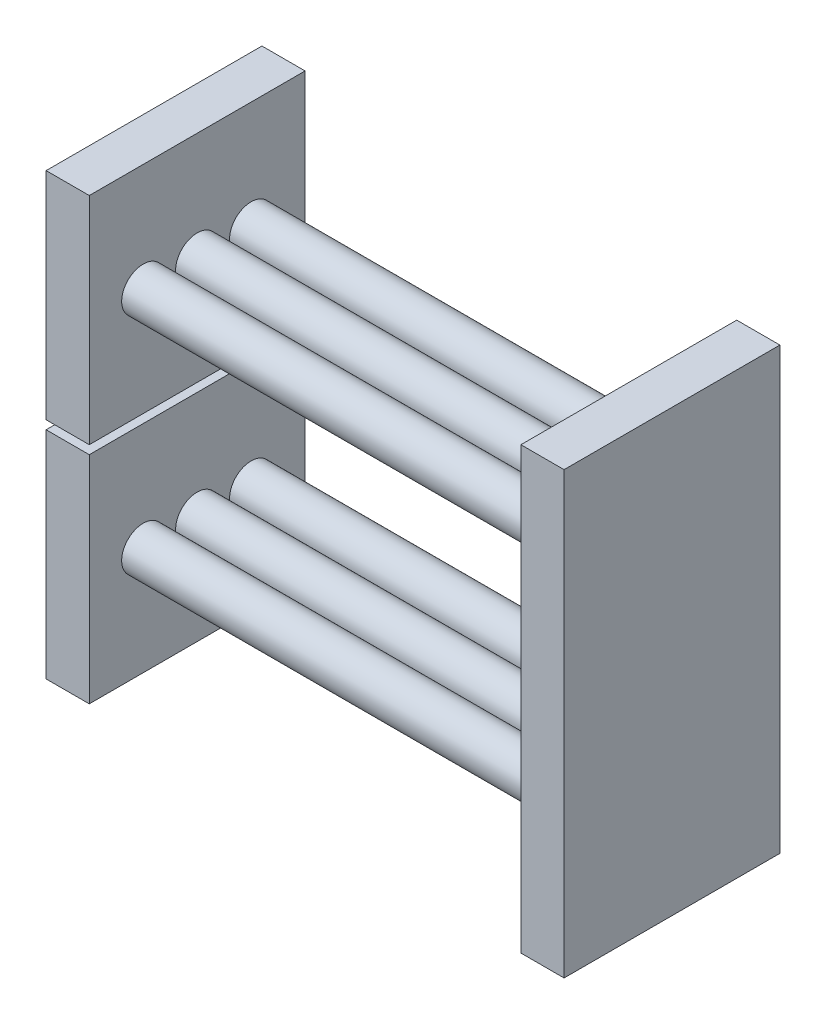
ISO-10303-21;
HEADER;
FILE_DESCRIPTION(('STEP AP214'),'2;1');
FILE_NAME('part.step','',(''),(''),'','','');
FILE_SCHEMA(('AUTOMOTIVE_DESIGN { 1 0 10303 214 1 1 1 1 }'));
ENDSEC;
DATA;
#1=APPLICATION_CONTEXT('core data for automotive mechanical design processes');
#2=APPLICATION_PROTOCOL_DEFINITION('international standard','automotive_design',2000,#1);
#3=PRODUCT_CONTEXT('',#1,'mechanical');
#4=PRODUCT('Part','Part','',(#3));
#5=PRODUCT_RELATED_PRODUCT_CATEGORY('part','',(#4));
#6=PRODUCT_DEFINITION_FORMATION('','',#4);
#7=PRODUCT_DEFINITION_CONTEXT('part definition',#1,'design');
#8=PRODUCT_DEFINITION('design','',#6,#7);
#9=PRODUCT_DEFINITION_SHAPE('','',#8);
#10=(LENGTH_UNIT() NAMED_UNIT(*) SI_UNIT(.MILLI.,.METRE.));
#11=(NAMED_UNIT(*) PLANE_ANGLE_UNIT() SI_UNIT($,.RADIAN.));
#12=(NAMED_UNIT(*) SI_UNIT($,.STERADIAN.) SOLID_ANGLE_UNIT());
#13=UNCERTAINTY_MEASURE_WITH_UNIT(LENGTH_MEASURE(1.E-05),#10,'distance_accuracy_value','');
#14=(GEOMETRIC_REPRESENTATION_CONTEXT(3) GLOBAL_UNCERTAINTY_ASSIGNED_CONTEXT((#13)) GLOBAL_UNIT_ASSIGNED_CONTEXT((#10,
#11,#12)) REPRESENTATION_CONTEXT('',''));
#15=CARTESIAN_POINT('',(0.,0.,0.));
#16=DIRECTION('',(0.,0.,1.));
#17=DIRECTION('',(1.,0.,0.));
#18=AXIS2_PLACEMENT_3D('',#15,#16,#17);
#19=CARTESIAN_POINT('',(0.,-52.,0.));
#20=DIRECTION('',(1.,0.,0.));
#21=DIRECTION('',(0.,0.,-1.));
#22=AXIS2_PLACEMENT_3D('',#19,#20,#21);
#23=PLANE('',#22);
#24=DIRECTION('',(0.,-1.,0.));
#25=VECTOR('',#24,1.);
#26=CARTESIAN_POINT('',(0.,-27.,-25.));
#27=LINE('',#26,#25);
#28=CARTESIAN_POINT('',(0.,-27.,-25.));
#29=VERTEX_POINT('',#28);
#30=CARTESIAN_POINT('',(0.,-77.,-25.));
#31=VERTEX_POINT('',#30);
#32=EDGE_CURVE('E181',#29,#31,#27,.T.);
#33=ORIENTED_EDGE('',*,*,#32,.T.);
#34=DIRECTION('',(0.,0.,1.));
#35=VECTOR('',#34,1.);
#36=CARTESIAN_POINT('',(0.,-77.,-25.));
#37=LINE('',#36,#35);
#38=CARTESIAN_POINT('',(0.,-77.,25.));
#39=VERTEX_POINT('',#38);
#40=EDGE_CURVE('E198',#31,#39,#37,.T.);
#41=ORIENTED_EDGE('',*,*,#40,.T.);
#42=DIRECTION('',(0.,-1.,0.));
#43=VECTOR('',#42,1.);
#44=CARTESIAN_POINT('',(0.,-27.,25.));
#45=LINE('',#44,#43);
#46=CARTESIAN_POINT('',(0.,-27.,25.));
#47=VERTEX_POINT('',#46);
#48=EDGE_CURVE('E201',#47,#39,#45,.T.);
#49=ORIENTED_EDGE('',*,*,#48,.F.);
#50=DIRECTION('',(0.,0.,1.));
#51=VECTOR('',#50,1.);
#52=CARTESIAN_POINT('',(0.,-27.,-25.));
#53=LINE('',#52,#51);
#54=EDGE_CURVE('E188',#29,#47,#53,.T.);
#55=ORIENTED_EDGE('',*,*,#54,.F.);
#56=EDGE_LOOP('',(#33,#41,#49,#55));
#57=FACE_BOUND('',#56,.T.);
#58=CARTESIAN_POINT('',(0.,-47.,4.99999999999999));
#59=DIRECTION('',(1.,0.,0.));
#60=DIRECTION('',(0.,0.,-1.));
#61=AXIS2_PLACEMENT_3D('',#58,#59,#60);
#62=CIRCLE('',#61,10.);
#63=CARTESIAN_POINT('',(0.,-47.,-5.00000000000001));
#64=VERTEX_POINT('',#63);
#65=EDGE_CURVE('E11',#64,#64,#62,.F.);
#66=ORIENTED_EDGE('',*,*,#65,.F.);
#67=EDGE_LOOP('',(#66));
#68=FACE_BOUND('',#67,.T.);
#69=ADVANCED_FACE('F39',(#57,#68),#23,.F.);
#70=CARTESIAN_POINT('',(0.,0.,0.));
#71=DIRECTION('',(1.,0.,0.));
#72=DIRECTION('',(0.,0.,-1.));
#73=AXIS2_PLACEMENT_3D('',#70,#71,#72);
#74=PLANE('',#73);
#75=DIRECTION('',(0.,1.,0.));
#76=VECTOR('',#75,1.);
#77=CARTESIAN_POINT('',(0.,-25.,-25.));
#78=LINE('',#77,#76);
#79=CARTESIAN_POINT('',(0.,-25.,-25.));
#80=VERTEX_POINT('',#79);
#81=CARTESIAN_POINT('',(0.,25.,-25.));
#82=VERTEX_POINT('',#81);
#83=EDGE_CURVE('E243',#80,#82,#78,.T.);
#84=ORIENTED_EDGE('',*,*,#83,.F.);
#85=DIRECTION('',(0.,0.,1.));
#86=VECTOR('',#85,1.);
#87=CARTESIAN_POINT('',(0.,-25.,-25.));
#88=LINE('',#87,#86);
#89=CARTESIAN_POINT('',(0.,-25.,25.));
#90=VERTEX_POINT('',#89);
#91=EDGE_CURVE('E248',#80,#90,#88,.T.);
#92=ORIENTED_EDGE('',*,*,#91,.T.);
#93=DIRECTION('',(0.,1.,0.));
#94=VECTOR('',#93,1.);
#95=CARTESIAN_POINT('',(0.,-25.,25.));
#96=LINE('',#95,#94);
#97=CARTESIAN_POINT('',(0.,25.,25.));
#98=VERTEX_POINT('',#97);
#99=EDGE_CURVE('E259',#90,#98,#96,.T.);
#100=ORIENTED_EDGE('',*,*,#99,.T.);
#101=DIRECTION('',(0.,0.,1.));
#102=VECTOR('',#101,1.);
#103=CARTESIAN_POINT('',(0.,25.,-25.));
#104=LINE('',#103,#102);
#105=EDGE_CURVE('E256',#82,#98,#104,.T.);
#106=ORIENTED_EDGE('',*,*,#105,.F.);
#107=EDGE_LOOP('',(#84,#92,#100,#106));
#108=FACE_BOUND('',#107,.T.);
#109=CARTESIAN_POINT('',(0.,0.,4.99999999999999));
#110=DIRECTION('',(1.,0.,0.));
#111=DIRECTION('',(0.,0.,-1.));
#112=AXIS2_PLACEMENT_3D('',#109,#110,#111);
#113=CIRCLE('',#112,10.);
#114=CARTESIAN_POINT('',(0.,0.,-5.00000000000001));
#115=VERTEX_POINT('',#114);
#116=EDGE_CURVE('E49',#115,#115,#113,.F.);
#117=ORIENTED_EDGE('',*,*,#116,.F.);
#118=EDGE_LOOP('',(#117));
#119=FACE_BOUND('',#118,.T.);
#120=ADVANCED_FACE('F277',(#108,#119),#74,.F.);
#121=CARTESIAN_POINT('',(10.,-25.,-25.));
#122=DIRECTION('',(0.,0.,1.));
#123=DIRECTION('',(1.,0.,0.));
#124=AXIS2_PLACEMENT_3D('',#121,#122,#123);
#125=PLANE('',#124);
#126=ORIENTED_EDGE('',*,*,#83,.T.);
#127=DIRECTION('',(-1.,0.,0.));
#128=VECTOR('',#127,1.);
#129=CARTESIAN_POINT('',(10.,25.,-25.));
#130=LINE('',#129,#128);
#131=CARTESIAN_POINT('',(10.,25.,-25.));
#132=VERTEX_POINT('',#131);
#133=EDGE_CURVE('E268',#132,#82,#130,.T.);
#134=ORIENTED_EDGE('',*,*,#133,.F.);
#135=DIRECTION('',(0.,1.,0.));
#136=VECTOR('',#135,1.);
#137=CARTESIAN_POINT('',(10.,-25.,-25.));
#138=LINE('',#137,#136);
#139=CARTESIAN_POINT('',(10.,-25.,-25.));
#140=VERTEX_POINT('',#139);
#141=EDGE_CURVE('E246',#140,#132,#138,.T.);
#142=ORIENTED_EDGE('',*,*,#141,.F.);
#143=DIRECTION('',(-1.,0.,0.));
#144=VECTOR('',#143,1.);
#145=CARTESIAN_POINT('',(10.,-25.,-25.));
#146=LINE('',#145,#144);
#147=EDGE_CURVE('E57',#140,#80,#146,.T.);
#148=ORIENTED_EDGE('',*,*,#147,.T.);
#149=EDGE_LOOP('',(#126,#134,#142,#148));
#150=FACE_BOUND('',#149,.T.);
#151=ADVANCED_FACE('F41',(#150),#125,.F.);
#152=CARTESIAN_POINT('',(10.,25.,-25.));
#153=DIRECTION('',(0.,-1.,0.));
#154=DIRECTION('',(0.,0.,-1.));
#155=AXIS2_PLACEMENT_3D('',#152,#153,#154);
#156=PLANE('',#155);
#157=ORIENTED_EDGE('',*,*,#105,.T.);
#158=DIRECTION('',(-1.,0.,0.));
#159=VECTOR('',#158,1.);
#160=CARTESIAN_POINT('',(10.,25.,25.));
#161=LINE('',#160,#159);
#162=CARTESIAN_POINT('',(10.,25.,25.));
#163=VERTEX_POINT('',#162);
#164=EDGE_CURVE('E266',#163,#98,#161,.T.);
#165=ORIENTED_EDGE('',*,*,#164,.F.);
#166=DIRECTION('',(0.,0.,1.));
#167=VECTOR('',#166,1.);
#168=CARTESIAN_POINT('',(10.,25.,-25.));
#169=LINE('',#168,#167);
#170=EDGE_CURVE('E84',#132,#163,#169,.T.);
#171=ORIENTED_EDGE('',*,*,#170,.F.);
#172=ORIENTED_EDGE('',*,*,#133,.T.);
#173=EDGE_LOOP('',(#157,#165,#171,#172));
#174=FACE_BOUND('',#173,.T.);
#175=ADVANCED_FACE('F285',(#174),#156,.F.);
#176=CARTESIAN_POINT('',(10.,-25.,25.));
#177=DIRECTION('',(0.,0.,1.));
#178=DIRECTION('',(1.,0.,0.));
#179=AXIS2_PLACEMENT_3D('',#176,#177,#178);
#180=PLANE('',#179);
#181=ORIENTED_EDGE('',*,*,#99,.F.);
#182=DIRECTION('',(-1.,0.,0.));
#183=VECTOR('',#182,1.);
#184=CARTESIAN_POINT('',(10.,-25.,25.));
#185=LINE('',#184,#183);
#186=CARTESIAN_POINT('',(10.,-25.,25.));
#187=VERTEX_POINT('',#186);
#188=EDGE_CURVE('E72',#187,#90,#185,.T.);
#189=ORIENTED_EDGE('',*,*,#188,.F.);
#190=DIRECTION('',(0.,1.,0.));
#191=VECTOR('',#190,1.);
#192=CARTESIAN_POINT('',(10.,-25.,25.));
#193=LINE('',#192,#191);
#194=EDGE_CURVE('E250',#187,#163,#193,.T.);
#195=ORIENTED_EDGE('',*,*,#194,.T.);
#196=ORIENTED_EDGE('',*,*,#164,.T.);
#197=EDGE_LOOP('',(#181,#189,#195,#196));
#198=FACE_BOUND('',#197,.T.);
#199=ADVANCED_FACE('F306',(#198),#180,.T.);
#200=CARTESIAN_POINT('',(10.,-25.,-25.));
#201=DIRECTION('',(0.,-1.,0.));
#202=DIRECTION('',(0.,0.,-1.));
#203=AXIS2_PLACEMENT_3D('',#200,#201,#202);
#204=PLANE('',#203);
#205=ORIENTED_EDGE('',*,*,#91,.F.);
#206=ORIENTED_EDGE('',*,*,#147,.F.);
#207=DIRECTION('',(0.,0.,1.));
#208=VECTOR('',#207,1.);
#209=CARTESIAN_POINT('',(10.,-25.,-25.));
#210=LINE('',#209,#208);
#211=EDGE_CURVE('E253',#140,#187,#210,.T.);
#212=ORIENTED_EDGE('',*,*,#211,.T.);
#213=ORIENTED_EDGE('',*,*,#188,.T.);
#214=EDGE_LOOP('',(#205,#206,#212,#213));
#215=FACE_BOUND('',#214,.T.);
#216=ADVANCED_FACE('F301',(#215),#204,.T.);
#217=CARTESIAN_POINT('',(10.,0.,0.));
#218=DIRECTION('',(1.,0.,0.));
#219=DIRECTION('',(0.,0.,-1.));
#220=AXIS2_PLACEMENT_3D('',#217,#218,#219);
#221=PLANE('',#220);
#222=CARTESIAN_POINT('',(10.,0.,12.5));
#223=DIRECTION('',(1.,0.,0.));
#224=DIRECTION('',(0.,0.,-1.));
#225=AXIS2_PLACEMENT_3D('',#222,#223,#224);
#226=CIRCLE('',#225,5.);
#227=CARTESIAN_POINT('',(10.,0.,7.5));
#228=VERTEX_POINT('',#227);
#229=EDGE_CURVE('E227',#228,#228,#226,.T.);
#230=ORIENTED_EDGE('',*,*,#229,.F.);
#231=EDGE_LOOP('',(#230));
#232=FACE_BOUND('',#231,.T.);
#233=CARTESIAN_POINT('',(10.,0.,-12.5));
#234=DIRECTION('',(1.,0.,0.));
#235=DIRECTION('',(0.,0.,-1.));
#236=AXIS2_PLACEMENT_3D('',#233,#234,#235);
#237=CIRCLE('',#236,5.);
#238=CARTESIAN_POINT('',(10.,0.,-17.5));
#239=VERTEX_POINT('',#238);
#240=EDGE_CURVE('E233',#239,#239,#237,.T.);
#241=ORIENTED_EDGE('',*,*,#240,.F.);
#242=EDGE_LOOP('',(#241));
#243=FACE_BOUND('',#242,.T.);
#244=CARTESIAN_POINT('',(10.,0.,0.));
#245=DIRECTION('',(1.,0.,0.));
#246=DIRECTION('',(0.,0.,-1.));
#247=AXIS2_PLACEMENT_3D('',#244,#245,#246);
#248=CIRCLE('',#247,5.);
#249=CARTESIAN_POINT('',(10.,0.,-5.));
#250=VERTEX_POINT('',#249);
#251=EDGE_CURVE('E239',#250,#250,#248,.T.);
#252=ORIENTED_EDGE('',*,*,#251,.F.);
#253=EDGE_LOOP('',(#252));
#254=FACE_BOUND('',#253,.T.);
#255=ORIENTED_EDGE('',*,*,#141,.T.);
#256=ORIENTED_EDGE('',*,*,#170,.T.);
#257=ORIENTED_EDGE('',*,*,#194,.F.);
#258=ORIENTED_EDGE('',*,*,#211,.F.);
#259=EDGE_LOOP('',(#255,#256,#257,#258));
#260=FACE_BOUND('',#259,.T.);
#261=ADVANCED_FACE('F293',(#232,#243,#254,#260),#221,.T.);
#262=ORIENTED_EDGE('',*,*,#116,.T.);
#263=EDGE_LOOP('',(#262));
#264=FACE_BOUND('',#263,.T.);
#265=ADVANCED_FACE('F275',(#264),#74,.F.);
#266=CARTESIAN_POINT('',(110.,0.,0.));
#267=DIRECTION('',(-1.,0.,0.));
#268=DIRECTION('',(0.,0.,1.));
#269=AXIS2_PLACEMENT_3D('',#266,#267,#268);
#270=CYLINDRICAL_SURFACE('',#269,5.);
#271=CARTESIAN_POINT('',(110.,0.,0.));
#272=DIRECTION('',(1.,0.,0.));
#273=DIRECTION('',(0.,0.,-1.));
#274=AXIS2_PLACEMENT_3D('',#271,#272,#273);
#275=CIRCLE('',#274,5.);
#276=CARTESIAN_POINT('',(110.,0.,-5.));
#277=VERTEX_POINT('',#276);
#278=EDGE_CURVE('E240',#277,#277,#275,.T.);
#279=ORIENTED_EDGE('',*,*,#278,.F.);
#280=EDGE_LOOP('',(#279));
#281=FACE_BOUND('',#280,.T.);
#282=ORIENTED_EDGE('',*,*,#251,.T.);
#283=EDGE_LOOP('',(#282));
#284=FACE_BOUND('',#283,.T.);
#285=ADVANCED_FACE('F292',(#281,#284),#270,.T.);
#286=CARTESIAN_POINT('',(110.,0.,-12.5));
#287=DIRECTION('',(-1.,0.,0.));
#288=DIRECTION('',(0.,0.,1.));
#289=AXIS2_PLACEMENT_3D('',#286,#287,#288);
#290=CYLINDRICAL_SURFACE('',#289,5.);
#291=CARTESIAN_POINT('',(110.,0.,-12.5));
#292=DIRECTION('',(1.,0.,0.));
#293=DIRECTION('',(0.,0.,-1.));
#294=AXIS2_PLACEMENT_3D('',#291,#292,#293);
#295=CIRCLE('',#294,5.);
#296=CARTESIAN_POINT('',(110.,0.,-17.5));
#297=VERTEX_POINT('',#296);
#298=EDGE_CURVE('E236',#297,#297,#295,.T.);
#299=ORIENTED_EDGE('',*,*,#298,.F.);
#300=EDGE_LOOP('',(#299));
#301=FACE_BOUND('',#300,.T.);
#302=ORIENTED_EDGE('',*,*,#240,.T.);
#303=EDGE_LOOP('',(#302));
#304=FACE_BOUND('',#303,.T.);
#305=ADVANCED_FACE('F298',(#301,#304),#290,.T.);
#306=CARTESIAN_POINT('',(110.,0.,12.5));
#307=DIRECTION('',(-1.,0.,0.));
#308=DIRECTION('',(0.,0.,1.));
#309=AXIS2_PLACEMENT_3D('',#306,#307,#308);
#310=CYLINDRICAL_SURFACE('',#309,5.);
#311=CARTESIAN_POINT('',(110.,0.,12.5));
#312=DIRECTION('',(1.,0.,0.));
#313=DIRECTION('',(0.,0.,-1.));
#314=AXIS2_PLACEMENT_3D('',#311,#312,#313);
#315=CIRCLE('',#314,5.);
#316=CARTESIAN_POINT('',(110.,0.,7.5));
#317=VERTEX_POINT('',#316);
#318=EDGE_CURVE('E230',#317,#317,#315,.T.);
#319=ORIENTED_EDGE('',*,*,#318,.F.);
#320=EDGE_LOOP('',(#319));
#321=FACE_BOUND('',#320,.T.);
#322=ORIENTED_EDGE('',*,*,#229,.T.);
#323=EDGE_LOOP('',(#322));
#324=FACE_BOUND('',#323,.T.);
#325=ADVANCED_FACE('F312',(#321,#324),#310,.T.);
#326=CARTESIAN_POINT('',(120.,25.,25.));
#327=DIRECTION('',(0.,0.,-1.));
#328=DIRECTION('',(0.,1.,0.));
#329=AXIS2_PLACEMENT_3D('',#326,#327,#328);
#330=PLANE('',#329);
#331=DIRECTION('',(0.,-1.,0.));
#332=VECTOR('',#331,1.);
#333=CARTESIAN_POINT('',(110.,25.,25.));
#334=LINE('',#333,#332);
#335=CARTESIAN_POINT('',(110.,25.,25.));
#336=VERTEX_POINT('',#335);
#337=CARTESIAN_POINT('',(110.,-77.,25.));
#338=VERTEX_POINT('',#337);
#339=EDGE_CURVE('E215',#336,#338,#334,.T.);
#340=ORIENTED_EDGE('',*,*,#339,.T.);
#341=DIRECTION('',(-1.,0.,0.));
#342=VECTOR('',#341,1.);
#343=CARTESIAN_POINT('',(120.,-77.,25.));
#344=LINE('',#343,#342);
#345=CARTESIAN_POINT('',(120.,-77.,25.));
#346=VERTEX_POINT('',#345);
#347=EDGE_CURVE('E155',#346,#338,#344,.T.);
#348=ORIENTED_EDGE('',*,*,#347,.F.);
#349=DIRECTION('',(0.,-1.,0.));
#350=VECTOR('',#349,1.);
#351=CARTESIAN_POINT('',(120.,25.,25.));
#352=LINE('',#351,#350);
#353=CARTESIAN_POINT('',(120.,25.,25.));
#354=VERTEX_POINT('',#353);
#355=EDGE_CURVE('E146',#354,#346,#352,.T.);
#356=ORIENTED_EDGE('',*,*,#355,.F.);
#357=DIRECTION('',(-1.,0.,0.));
#358=VECTOR('',#357,1.);
#359=CARTESIAN_POINT('',(120.,25.,25.));
#360=LINE('',#359,#358);
#361=EDGE_CURVE('E219',#354,#336,#360,.T.);
#362=ORIENTED_EDGE('',*,*,#361,.T.);
#363=EDGE_LOOP('',(#340,#348,#356,#362));
#364=FACE_BOUND('',#363,.T.);
#365=ADVANCED_FACE('F316',(#364),#330,.F.);
#366=CARTESIAN_POINT('',(120.,25.,-25.));
#367=DIRECTION('',(0.,0.,1.));
#368=DIRECTION('',(0.,-1.,0.));
#369=AXIS2_PLACEMENT_3D('',#366,#367,#368);
#370=PLANE('',#369);
#371=DIRECTION('',(0.,1.,0.));
#372=VECTOR('',#371,1.);
#373=CARTESIAN_POINT('',(110.,25.,-25.));
#374=LINE('',#373,#372);
#375=CARTESIAN_POINT('',(110.,-77.,-25.));
#376=VERTEX_POINT('',#375);
#377=CARTESIAN_POINT('',(110.,25.,-25.));
#378=VERTEX_POINT('',#377);
#379=EDGE_CURVE('E221',#376,#378,#374,.T.);
#380=ORIENTED_EDGE('',*,*,#379,.T.);
#381=DIRECTION('',(-1.,0.,0.));
#382=VECTOR('',#381,1.);
#383=CARTESIAN_POINT('',(120.,25.,-25.));
#384=LINE('',#383,#382);
#385=CARTESIAN_POINT('',(120.,25.,-25.));
#386=VERTEX_POINT('',#385);
#387=EDGE_CURVE('E142',#386,#378,#384,.T.);
#388=ORIENTED_EDGE('',*,*,#387,.F.);
#389=DIRECTION('',(0.,1.,0.));
#390=VECTOR('',#389,1.);
#391=CARTESIAN_POINT('',(120.,25.,-25.));
#392=LINE('',#391,#390);
#393=CARTESIAN_POINT('',(120.,-77.,-25.));
#394=VERTEX_POINT('',#393);
#395=EDGE_CURVE('E136',#394,#386,#392,.T.);
#396=ORIENTED_EDGE('',*,*,#395,.F.);
#397=DIRECTION('',(-1.,0.,0.));
#398=VECTOR('',#397,1.);
#399=CARTESIAN_POINT('',(120.,-77.,-25.));
#400=LINE('',#399,#398);
#401=EDGE_CURVE('E140',#394,#376,#400,.T.);
#402=ORIENTED_EDGE('',*,*,#401,.T.);
#403=EDGE_LOOP('',(#380,#388,#396,#402));
#404=FACE_BOUND('',#403,.T.);
#405=ADVANCED_FACE('F138',(#404),#370,.F.);
#406=CARTESIAN_POINT('',(120.,25.,25.));
#407=DIRECTION('',(0.,-1.,0.));
#408=DIRECTION('',(0.,0.,-1.));
#409=AXIS2_PLACEMENT_3D('',#406,#407,#408);
#410=PLANE('',#409);
#411=DIRECTION('',(0.,0.,1.));
#412=VECTOR('',#411,1.);
#413=CARTESIAN_POINT('',(110.,25.,25.));
#414=LINE('',#413,#412);
#415=EDGE_CURVE('E216',#378,#336,#414,.T.);
#416=ORIENTED_EDGE('',*,*,#415,.T.);
#417=ORIENTED_EDGE('',*,*,#361,.F.);
#418=DIRECTION('',(0.,0.,1.));
#419=VECTOR('',#418,1.);
#420=CARTESIAN_POINT('',(120.,25.,25.));
#421=LINE('',#420,#419);
#422=EDGE_CURVE('E145',#386,#354,#421,.T.);
#423=ORIENTED_EDGE('',*,*,#422,.F.);
#424=ORIENTED_EDGE('',*,*,#387,.T.);
#425=EDGE_LOOP('',(#416,#417,#423,#424));
#426=FACE_BOUND('',#425,.T.);
#427=ADVANCED_FACE('F323',(#426),#410,.F.);
#428=CARTESIAN_POINT('',(120.,0.,0.));
#429=DIRECTION('',(1.,0.,0.));
#430=DIRECTION('',(0.,0.,-1.));
#431=AXIS2_PLACEMENT_3D('',#428,#429,#430);
#432=PLANE('',#431);
#433=ORIENTED_EDGE('',*,*,#355,.T.);
#434=DIRECTION('',(0.,0.,1.));
#435=VECTOR('',#434,1.);
#436=CARTESIAN_POINT('',(120.,-77.,25.));
#437=LINE('',#436,#435);
#438=EDGE_CURVE('E149',#394,#346,#437,.T.);
#439=ORIENTED_EDGE('',*,*,#438,.F.);
#440=ORIENTED_EDGE('',*,*,#395,.T.);
#441=ORIENTED_EDGE('',*,*,#422,.T.);
#442=EDGE_LOOP('',(#433,#439,#440,#441));
#443=FACE_BOUND('',#442,.T.);
#444=ADVANCED_FACE('F150',(#443),#432,.T.);
#445=CARTESIAN_POINT('',(110.,0.,0.));
#446=DIRECTION('',(1.,0.,0.));
#447=DIRECTION('',(0.,0.,-1.));
#448=AXIS2_PLACEMENT_3D('',#445,#446,#447);
#449=PLANE('',#448);
#450=ORIENTED_EDGE('',*,*,#278,.T.);
#451=EDGE_LOOP('',(#450));
#452=FACE_BOUND('',#451,.T.);
#453=ORIENTED_EDGE('',*,*,#298,.T.);
#454=EDGE_LOOP('',(#453));
#455=FACE_BOUND('',#454,.T.);
#456=ORIENTED_EDGE('',*,*,#318,.T.);
#457=EDGE_LOOP('',(#456));
#458=FACE_BOUND('',#457,.T.);
#459=ORIENTED_EDGE('',*,*,#339,.F.);
#460=ORIENTED_EDGE('',*,*,#415,.F.);
#461=ORIENTED_EDGE('',*,*,#379,.F.);
#462=DIRECTION('',(0.,0.,1.));
#463=VECTOR('',#462,1.);
#464=CARTESIAN_POINT('',(110.,-77.,25.));
#465=LINE('',#464,#463);
#466=EDGE_CURVE('E156',#376,#338,#465,.T.);
#467=ORIENTED_EDGE('',*,*,#466,.T.);
#468=EDGE_LOOP('',(#459,#460,#461,#467));
#469=FACE_BOUND('',#468,.T.);
#470=CARTESIAN_POINT('',(110.,-52.,0.));
#471=DIRECTION('',(-1.,0.,0.));
#472=DIRECTION('',(0.,0.,-1.));
#473=AXIS2_PLACEMENT_3D('',#470,#471,#472);
#474=CIRCLE('',#473,5.);
#475=CARTESIAN_POINT('',(110.,-52.,-5.00000000000001));
#476=VERTEX_POINT('',#475);
#477=EDGE_CURVE('E178',#476,#476,#474,.T.);
#478=ORIENTED_EDGE('',*,*,#477,.F.);
#479=EDGE_LOOP('',(#478));
#480=FACE_BOUND('',#479,.T.);
#481=CARTESIAN_POINT('',(110.,-52.,-12.5));
#482=DIRECTION('',(-1.,0.,0.));
#483=DIRECTION('',(0.,0.,-1.));
#484=AXIS2_PLACEMENT_3D('',#481,#482,#483);
#485=CIRCLE('',#484,5.);
#486=CARTESIAN_POINT('',(110.,-52.,-17.5));
#487=VERTEX_POINT('',#486);
#488=EDGE_CURVE('E174',#487,#487,#485,.T.);
#489=ORIENTED_EDGE('',*,*,#488,.F.);
#490=EDGE_LOOP('',(#489));
#491=FACE_BOUND('',#490,.T.);
#492=CARTESIAN_POINT('',(110.,-52.,12.5));
#493=DIRECTION('',(-1.,0.,0.));
#494=DIRECTION('',(0.,0.,-1.));
#495=AXIS2_PLACEMENT_3D('',#492,#493,#494);
#496=CIRCLE('',#495,5.);
#497=CARTESIAN_POINT('',(110.,-52.,7.49999999999999));
#498=VERTEX_POINT('',#497);
#499=EDGE_CURVE('E164',#498,#498,#496,.T.);
#500=ORIENTED_EDGE('',*,*,#499,.F.);
#501=EDGE_LOOP('',(#500));
#502=FACE_BOUND('',#501,.T.);
#503=ADVANCED_FACE('F327',(#452,#455,#458,#469,#480,#491,#502),#449,.F.);
#504=CARTESIAN_POINT('',(10.,-27.,-25.));
#505=DIRECTION('',(0.,0.,1.));
#506=DIRECTION('',(1.,0.,0.));
#507=AXIS2_PLACEMENT_3D('',#504,#505,#506);
#508=PLANE('',#507);
#509=ORIENTED_EDGE('',*,*,#32,.F.);
#510=DIRECTION('',(-1.,0.,0.));
#511=VECTOR('',#510,1.);
#512=CARTESIAN_POINT('',(10.,-27.,-25.));
#513=LINE('',#512,#511);
#514=CARTESIAN_POINT('',(10.,-27.,-25.));
#515=VERTEX_POINT('',#514);
#516=EDGE_CURVE('E195',#515,#29,#513,.T.);
#517=ORIENTED_EDGE('',*,*,#516,.F.);
#518=DIRECTION('',(0.,-1.,0.));
#519=VECTOR('',#518,1.);
#520=CARTESIAN_POINT('',(10.,-27.,-25.));
#521=LINE('',#520,#519);
#522=CARTESIAN_POINT('',(10.,-77.,-25.));
#523=VERTEX_POINT('',#522);
#524=EDGE_CURVE('E184',#515,#523,#521,.T.);
#525=ORIENTED_EDGE('',*,*,#524,.T.);
#526=DIRECTION('',(-1.,0.,0.));
#527=VECTOR('',#526,1.);
#528=CARTESIAN_POINT('',(10.,-77.,-25.));
#529=LINE('',#528,#527);
#530=EDGE_CURVE('E212',#523,#31,#529,.T.);
#531=ORIENTED_EDGE('',*,*,#530,.T.);
#532=EDGE_LOOP('',(#509,#517,#525,#531));
#533=FACE_BOUND('',#532,.T.);
#534=ADVANCED_FACE('F330',(#533),#508,.F.);
#535=CARTESIAN_POINT('',(10.,-77.,-25.));
#536=DIRECTION('',(0.,1.,0.));
#537=DIRECTION('',(0.,0.,-1.));
#538=AXIS2_PLACEMENT_3D('',#535,#536,#537);
#539=PLANE('',#538);
#540=ORIENTED_EDGE('',*,*,#40,.F.);
#541=ORIENTED_EDGE('',*,*,#530,.F.);
#542=DIRECTION('',(0.,0.,1.));
#543=VECTOR('',#542,1.);
#544=CARTESIAN_POINT('',(10.,-77.,-25.));
#545=LINE('',#544,#543);
#546=CARTESIAN_POINT('',(10.,-77.,25.));
#547=VERTEX_POINT('',#546);
#548=EDGE_CURVE('E187',#523,#547,#545,.T.);
#549=ORIENTED_EDGE('',*,*,#548,.T.);
#550=DIRECTION('',(-1.,0.,0.));
#551=VECTOR('',#550,1.);
#552=CARTESIAN_POINT('',(10.,-77.,25.));
#553=LINE('',#552,#551);
#554=EDGE_CURVE('E209',#547,#39,#553,.T.);
#555=ORIENTED_EDGE('',*,*,#554,.T.);
#556=EDGE_LOOP('',(#540,#541,#549,#555));
#557=FACE_BOUND('',#556,.T.);
#558=ADVANCED_FACE('F336',(#557),#539,.F.);
#559=CARTESIAN_POINT('',(10.,-27.,25.));
#560=DIRECTION('',(0.,0.,1.));
#561=DIRECTION('',(1.,0.,0.));
#562=AXIS2_PLACEMENT_3D('',#559,#560,#561);
#563=PLANE('',#562);
#564=ORIENTED_EDGE('',*,*,#48,.T.);
#565=ORIENTED_EDGE('',*,*,#554,.F.);
#566=DIRECTION('',(0.,-1.,0.));
#567=VECTOR('',#566,1.);
#568=CARTESIAN_POINT('',(10.,-27.,25.));
#569=LINE('',#568,#567);
#570=CARTESIAN_POINT('',(10.,-27.,25.));
#571=VERTEX_POINT('',#570);
#572=EDGE_CURVE('E191',#571,#547,#569,.T.);
#573=ORIENTED_EDGE('',*,*,#572,.F.);
#574=DIRECTION('',(-1.,0.,0.));
#575=VECTOR('',#574,1.);
#576=CARTESIAN_POINT('',(10.,-27.,25.));
#577=LINE('',#576,#575);
#578=EDGE_CURVE('E206',#571,#47,#577,.T.);
#579=ORIENTED_EDGE('',*,*,#578,.T.);
#580=EDGE_LOOP('',(#564,#565,#573,#579));
#581=FACE_BOUND('',#580,.T.);
#582=ADVANCED_FACE('F340',(#581),#563,.T.);
#583=CARTESIAN_POINT('',(10.,-27.,-25.));
#584=DIRECTION('',(0.,1.,0.));
#585=DIRECTION('',(0.,0.,-1.));
#586=AXIS2_PLACEMENT_3D('',#583,#584,#585);
#587=PLANE('',#586);
#588=ORIENTED_EDGE('',*,*,#54,.T.);
#589=ORIENTED_EDGE('',*,*,#578,.F.);
#590=DIRECTION('',(0.,0.,1.));
#591=VECTOR('',#590,1.);
#592=CARTESIAN_POINT('',(10.,-27.,-25.));
#593=LINE('',#592,#591);
#594=EDGE_CURVE('E193',#515,#571,#593,.T.);
#595=ORIENTED_EDGE('',*,*,#594,.F.);
#596=ORIENTED_EDGE('',*,*,#516,.T.);
#597=EDGE_LOOP('',(#588,#589,#595,#596));
#598=FACE_BOUND('',#597,.T.);
#599=ADVANCED_FACE('F344',(#598),#587,.T.);
#600=CARTESIAN_POINT('',(10.,-52.,0.));
#601=DIRECTION('',(1.,0.,0.));
#602=DIRECTION('',(0.,0.,-1.));
#603=AXIS2_PLACEMENT_3D('',#600,#601,#602);
#604=PLANE('',#603);
#605=CARTESIAN_POINT('',(10.,-52.,12.5));
#606=DIRECTION('',(-1.,0.,0.));
#607=DIRECTION('',(0.,0.,-1.));
#608=AXIS2_PLACEMENT_3D('',#605,#606,#607);
#609=CIRCLE('',#608,5.);
#610=CARTESIAN_POINT('',(10.,-52.,7.49999999999999));
#611=VERTEX_POINT('',#610);
#612=EDGE_CURVE('E161',#611,#611,#609,.T.);
#613=ORIENTED_EDGE('',*,*,#612,.T.);
#614=EDGE_LOOP('',(#613));
#615=FACE_BOUND('',#614,.T.);
#616=CARTESIAN_POINT('',(10.,-52.,-12.5));
#617=DIRECTION('',(-1.,0.,0.));
#618=DIRECTION('',(0.,0.,-1.));
#619=AXIS2_PLACEMENT_3D('',#616,#617,#618);
#620=CIRCLE('',#619,5.);
#621=CARTESIAN_POINT('',(10.,-52.,-17.5));
#622=VERTEX_POINT('',#621);
#623=EDGE_CURVE('E171',#622,#622,#620,.T.);
#624=ORIENTED_EDGE('',*,*,#623,.T.);
#625=EDGE_LOOP('',(#624));
#626=FACE_BOUND('',#625,.T.);
#627=CARTESIAN_POINT('',(10.,-52.,0.));
#628=DIRECTION('',(-1.,0.,0.));
#629=DIRECTION('',(0.,0.,-1.));
#630=AXIS2_PLACEMENT_3D('',#627,#628,#629);
#631=CIRCLE('',#630,5.);
#632=CARTESIAN_POINT('',(10.,-52.,-5.00000000000001));
#633=VERTEX_POINT('',#632);
#634=EDGE_CURVE('E177',#633,#633,#631,.T.);
#635=ORIENTED_EDGE('',*,*,#634,.T.);
#636=EDGE_LOOP('',(#635));
#637=FACE_BOUND('',#636,.T.);
#638=ORIENTED_EDGE('',*,*,#524,.F.);
#639=ORIENTED_EDGE('',*,*,#594,.T.);
#640=ORIENTED_EDGE('',*,*,#572,.T.);
#641=ORIENTED_EDGE('',*,*,#548,.F.);
#642=EDGE_LOOP('',(#638,#639,#640,#641));
#643=FACE_BOUND('',#642,.T.);
#644=ADVANCED_FACE('F347',(#615,#626,#637,#643),#604,.T.);
#645=ORIENTED_EDGE('',*,*,#65,.T.);
#646=EDGE_LOOP('',(#645));
#647=FACE_BOUND('',#646,.T.);
#648=ADVANCED_FACE('F288',(#647),#23,.F.);
#649=CARTESIAN_POINT('',(110.,-52.,0.));
#650=DIRECTION('',(-1.,0.,0.));
#651=DIRECTION('',(0.,0.,1.));
#652=AXIS2_PLACEMENT_3D('',#649,#650,#651);
#653=CYLINDRICAL_SURFACE('',#652,5.);
#654=ORIENTED_EDGE('',*,*,#477,.T.);
#655=EDGE_LOOP('',(#654));
#656=FACE_BOUND('',#655,.T.);
#657=ORIENTED_EDGE('',*,*,#634,.F.);
#658=EDGE_LOOP('',(#657));
#659=FACE_BOUND('',#658,.T.);
#660=ADVANCED_FACE('F351',(#656,#659),#653,.T.);
#661=CARTESIAN_POINT('',(110.,-52.,-12.5));
#662=DIRECTION('',(-1.,0.,0.));
#663=DIRECTION('',(0.,0.,1.));
#664=AXIS2_PLACEMENT_3D('',#661,#662,#663);
#665=CYLINDRICAL_SURFACE('',#664,5.);
#666=ORIENTED_EDGE('',*,*,#488,.T.);
#667=EDGE_LOOP('',(#666));
#668=FACE_BOUND('',#667,.T.);
#669=ORIENTED_EDGE('',*,*,#623,.F.);
#670=EDGE_LOOP('',(#669));
#671=FACE_BOUND('',#670,.T.);
#672=ADVANCED_FACE('F358',(#668,#671),#665,.T.);
#673=CARTESIAN_POINT('',(110.,-52.,12.5));
#674=DIRECTION('',(-1.,0.,0.));
#675=DIRECTION('',(0.,0.,1.));
#676=AXIS2_PLACEMENT_3D('',#673,#674,#675);
#677=CYLINDRICAL_SURFACE('',#676,5.);
#678=ORIENTED_EDGE('',*,*,#499,.T.);
#679=EDGE_LOOP('',(#678));
#680=FACE_BOUND('',#679,.T.);
#681=ORIENTED_EDGE('',*,*,#612,.F.);
#682=EDGE_LOOP('',(#681));
#683=FACE_BOUND('',#682,.T.);
#684=ADVANCED_FACE('F362',(#680,#683),#677,.T.);
#685=CARTESIAN_POINT('',(120.,-77.,25.));
#686=DIRECTION('',(0.,1.,0.));
#687=DIRECTION('',(0.,0.,-1.));
#688=AXIS2_PLACEMENT_3D('',#685,#686,#687);
#689=PLANE('',#688);
#690=ORIENTED_EDGE('',*,*,#466,.F.);
#691=ORIENTED_EDGE('',*,*,#401,.F.);
#692=ORIENTED_EDGE('',*,*,#438,.T.);
#693=ORIENTED_EDGE('',*,*,#347,.T.);
#694=EDGE_LOOP('',(#690,#691,#692,#693));
#695=FACE_BOUND('',#694,.T.);
#696=ADVANCED_FACE('F159',(#695),#689,.F.);
#697=CLOSED_SHELL('',(#69,#120,#151,#175,#199,#216,#261,#265,#285,#305,#325,#365,#405,#427,#444,
#503,#534,#558,#582,#599,#644,#648,#660,#672,#684,#696));
#698=MANIFOLD_SOLID_BREP('B2',#697);
#699=ADVANCED_BREP_SHAPE_REPRESENTATION('',(#18,#698),#14);
#700=SHAPE_DEFINITION_REPRESENTATION(#9,#699);
ENDSEC;
END-ISO-10303-21;
